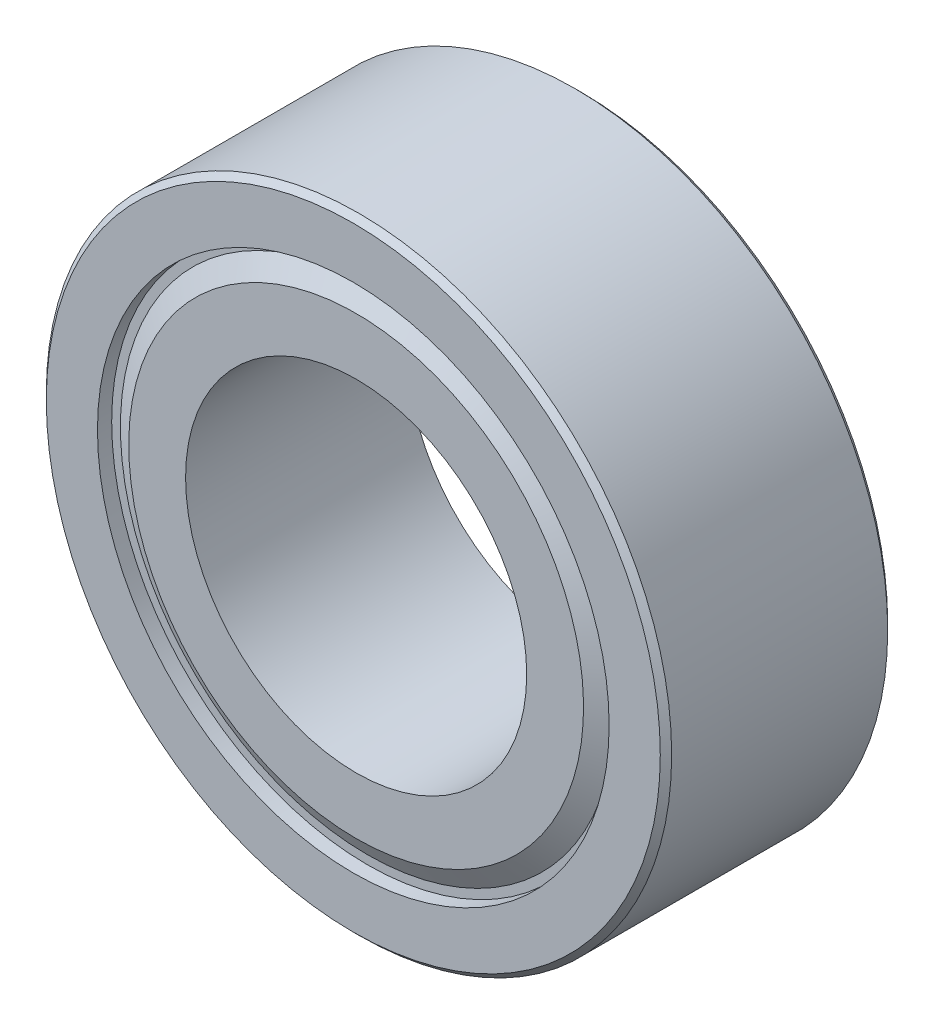
ISO-10303-21;
HEADER;
FILE_DESCRIPTION(('STEP AP214'),'2;1');
FILE_NAME('part.step','',(''),(''),'','','');
FILE_SCHEMA(('AUTOMOTIVE_DESIGN { 1 0 10303 214 1 1 1 1 }'));
ENDSEC;
DATA;
#1=APPLICATION_CONTEXT('core data for automotive mechanical design processes');
#2=APPLICATION_PROTOCOL_DEFINITION('international standard','automotive_design',2000,#1);
#3=PRODUCT_CONTEXT('',#1,'mechanical');
#4=PRODUCT('Part','Part','',(#3));
#5=PRODUCT_RELATED_PRODUCT_CATEGORY('part','',(#4));
#6=PRODUCT_DEFINITION_FORMATION('','',#4);
#7=PRODUCT_DEFINITION_CONTEXT('part definition',#1,'design');
#8=PRODUCT_DEFINITION('design','',#6,#7);
#9=PRODUCT_DEFINITION_SHAPE('','',#8);
#10=(LENGTH_UNIT() NAMED_UNIT(*) SI_UNIT(.MILLI.,.METRE.));
#11=(NAMED_UNIT(*) PLANE_ANGLE_UNIT() SI_UNIT($,.RADIAN.));
#12=(NAMED_UNIT(*) SI_UNIT($,.STERADIAN.) SOLID_ANGLE_UNIT());
#13=UNCERTAINTY_MEASURE_WITH_UNIT(LENGTH_MEASURE(1.E-05),#10,'distance_accuracy_value','');
#14=(GEOMETRIC_REPRESENTATION_CONTEXT(3) GLOBAL_UNCERTAINTY_ASSIGNED_CONTEXT((#13)) GLOBAL_UNIT_ASSIGNED_CONTEXT((#10,
#11,#12)) REPRESENTATION_CONTEXT('',''));
#15=CARTESIAN_POINT('',(0.,0.,0.));
#16=DIRECTION('',(0.,0.,1.));
#17=DIRECTION('',(1.,0.,0.));
#18=AXIS2_PLACEMENT_3D('',#15,#16,#17);
#19=CARTESIAN_POINT('',(0.,-1.65574434004337E-12,-1.12500000000007));
#20=DIRECTION('',(0.,0.,-1.));
#21=DIRECTION('',(0.,1.,0.));
#22=AXIS2_PLACEMENT_3D('',#19,#20,#21);
#23=CYLINDRICAL_SURFACE('',#22,4.50000000000236);
#24=CARTESIAN_POINT('',(0.,-1.65557290854692E-12,-1.25000000000007));
#25=DIRECTION('',(0.,0.,-1.));
#26=DIRECTION('',(1.,0.,0.));
#27=AXIS2_PLACEMENT_3D('',#24,#25,#26);
#28=CIRCLE('',#27,4.50000000000236);
#29=CARTESIAN_POINT('',(0.,-4.50000000000402,-1.25000000000007));
#30=VERTEX_POINT('',#29);
#31=EDGE_CURVE('E27',#30,#30,#28,.T.);
#32=ORIENTED_EDGE('',*,*,#31,.T.);
#33=DIRECTION('',(0.,0.,1.));
#34=VECTOR('',#33,1.);
#35=CARTESIAN_POINT('',(0.,-4.50000000000402,-1.12500000000007));
#36=LINE('',#35,#34);
#37=CARTESIAN_POINT('',(0.,-4.50000000000402,-1.00000000000007));
#38=VERTEX_POINT('',#37);
#39=EDGE_CURVE('E11',#30,#38,#36,.T.);
#40=ORIENTED_EDGE('',*,*,#39,.T.);
#41=CARTESIAN_POINT('',(0.,-1.65591577153982E-12,-1.00000000000007));
#42=DIRECTION('',(0.,0.,-1.));
#43=DIRECTION('',(1.,0.,0.));
#44=AXIS2_PLACEMENT_3D('',#41,#42,#43);
#45=CIRCLE('',#44,4.50000000000236);
#46=EDGE_CURVE('E131',#38,#38,#45,.T.);
#47=ORIENTED_EDGE('',*,*,#46,.F.);
#48=ORIENTED_EDGE('',*,*,#39,.F.);
#49=EDGE_LOOP('',(#32,#40,#47,#48));
#50=FACE_BOUND('',#49,.T.);
#51=ADVANCED_FACE('F18',(#50),#23,.F.);
#52=CARTESIAN_POINT('',(0.,4.5000000000007,-1.25000000000006));
#53=DIRECTION('',(0.,0.,1.));
#54=DIRECTION('',(0.,-1.,0.));
#55=AXIS2_PLACEMENT_3D('',#52,#53,#54);
#56=PLANE('',#55);
#57=CARTESIAN_POINT('',(0.,-1.65557290854692E-12,-1.25000000000006));
#58=DIRECTION('',(0.,0.,-1.));
#59=DIRECTION('',(1.,0.,0.));
#60=AXIS2_PLACEMENT_3D('',#57,#58,#59);
#61=CIRCLE('',#60,4.34641016151375);
#62=CARTESIAN_POINT('',(0.,-4.34641016151541,-1.25000000000007));
#63=VERTEX_POINT('',#62);
#64=EDGE_CURVE('E168',#63,#63,#61,.T.);
#65=ORIENTED_EDGE('',*,*,#64,.T.);
#66=EDGE_LOOP('',(#65));
#67=FACE_BOUND('',#66,.T.);
#68=ORIENTED_EDGE('',*,*,#31,.F.);
#69=EDGE_LOOP('',(#68));
#70=FACE_BOUND('',#69,.T.);
#71=ADVANCED_FACE('F20',(#67,#70),#56,.T.);
#72=CARTESIAN_POINT('',(0.,-1.65571005374408E-12,-1.15000000000007));
#73=DIRECTION('',(0.,0.,-1.));
#74=DIRECTION('',(0.,1.,0.));
#75=AXIS2_PLACEMENT_3D('',#72,#73,#74);
#76=CONICAL_SURFACE('',#75,4.17320508075688,1.04719755119659);
#77=ORIENTED_EDGE('',*,*,#64,.F.);
#78=DIRECTION('',(0.,0.866025403784435,0.500000000000007));
#79=VECTOR('',#78,1.);
#80=CARTESIAN_POINT('',(0.,-4.17320508075853,-1.15000000000007));
#81=LINE('',#80,#79);
#82=CARTESIAN_POINT('',(0.,-4.00000000000166,-1.05000000000008));
#83=VERTEX_POINT('',#82);
#84=EDGE_CURVE('E48',#63,#83,#81,.T.);
#85=ORIENTED_EDGE('',*,*,#84,.T.);
#86=CARTESIAN_POINT('',(0.,-1.65584719894124E-12,-1.05000000000008));
#87=DIRECTION('',(0.,0.,-1.));
#88=DIRECTION('',(1.,0.,0.));
#89=AXIS2_PLACEMENT_3D('',#86,#87,#88);
#90=CIRCLE('',#89,4.);
#91=EDGE_CURVE('E165',#83,#83,#90,.T.);
#92=ORIENTED_EDGE('',*,*,#91,.T.);
#93=ORIENTED_EDGE('',*,*,#84,.F.);
#94=EDGE_LOOP('',(#77,#85,#92,#93));
#95=FACE_BOUND('',#94,.T.);
#96=ADVANCED_FACE('F177',(#95),#76,.T.);
#97=CARTESIAN_POINT('',(0.,3.99999999999835,-1.05000000000007));
#98=DIRECTION('',(0.,0.,1.));
#99=DIRECTION('',(0.,-1.,0.));
#100=AXIS2_PLACEMENT_3D('',#97,#98,#99);
#101=PLANE('',#100);
#102=CARTESIAN_POINT('',(0.,-1.65584719894124E-12,-1.05000000000007));
#103=DIRECTION('',(0.,0.,-1.));
#104=DIRECTION('',(1.,0.,0.));
#105=AXIS2_PLACEMENT_3D('',#102,#103,#104);
#106=CIRCLE('',#105,3.);
#107=CARTESIAN_POINT('',(0.,-3.00000000000166,-1.05000000000008));
#108=VERTEX_POINT('',#107);
#109=EDGE_CURVE('E162',#108,#108,#106,.T.);
#110=ORIENTED_EDGE('',*,*,#109,.T.);
#111=EDGE_LOOP('',(#110));
#112=FACE_BOUND('',#111,.T.);
#113=ORIENTED_EDGE('',*,*,#91,.F.);
#114=EDGE_LOOP('',(#113));
#115=FACE_BOUND('',#114,.T.);
#116=ADVANCED_FACE('F184',(#112,#115),#101,.T.);
#117=CARTESIAN_POINT('',(0.,-1.65451003326894E-12,-2.02500000000007));
#118=DIRECTION('',(0.,0.,-1.));
#119=DIRECTION('',(0.,1.,0.));
#120=AXIS2_PLACEMENT_3D('',#117,#118,#119);
#121=CYLINDRICAL_SURFACE('',#120,3.);
#122=CARTESIAN_POINT('',(0.,-1.65049853625202E-12,-4.95000000000006));
#123=DIRECTION('',(0.,0.,-1.));
#124=DIRECTION('',(1.,0.,0.));
#125=AXIS2_PLACEMENT_3D('',#122,#123,#124);
#126=CIRCLE('',#125,3.);
#127=CARTESIAN_POINT('',(0.,-3.00000000000166,-4.95000000000006));
#128=VERTEX_POINT('',#127);
#129=EDGE_CURVE('E122',#128,#128,#126,.T.);
#130=ORIENTED_EDGE('',*,*,#129,.T.);
#131=DIRECTION('',(0.,0.,1.));
#132=VECTOR('',#131,1.);
#133=CARTESIAN_POINT('',(0.,-3.00000000000166,-2.02500000000007));
#134=LINE('',#133,#132);
#135=EDGE_CURVE('E158',#128,#108,#134,.T.);
#136=ORIENTED_EDGE('',*,*,#135,.T.);
#137=ORIENTED_EDGE('',*,*,#109,.F.);
#138=ORIENTED_EDGE('',*,*,#135,.F.);
#139=EDGE_LOOP('',(#130,#136,#137,#138));
#140=FACE_BOUND('',#139,.T.);
#141=ADVANCED_FACE('F189',(#140),#121,.F.);
#142=CARTESIAN_POINT('',(0.,-1.65447574696965E-12,-2.05000000000006));
#143=DIRECTION('',(0.,0.,-1.));
#144=DIRECTION('',(0.,1.,0.));
#145=AXIS2_PLACEMENT_3D('',#142,#143,#144);
#146=CYLINDRICAL_SURFACE('',#145,5.50000000000236);
#147=CARTESIAN_POINT('',(0.,-1.6505671088506E-12,-4.90000000000007));
#148=DIRECTION('',(0.,0.,-1.));
#149=DIRECTION('',(1.,0.,0.));
#150=AXIS2_PLACEMENT_3D('',#147,#148,#149);
#151=CIRCLE('',#150,5.50000000000236);
#152=CARTESIAN_POINT('',(0.,-5.50000000000401,-4.90000000000008));
#153=VERTEX_POINT('',#152);
#154=EDGE_CURVE('E103',#153,#153,#151,.T.);
#155=ORIENTED_EDGE('',*,*,#154,.F.);
#156=DIRECTION('',(0.,0.,1.));
#157=VECTOR('',#156,1.);
#158=CARTESIAN_POINT('',(0.,-5.50000000000401,-2.05000000000007));
#159=LINE('',#158,#157);
#160=CARTESIAN_POINT('',(0.,-5.50000000000401,-1.10000000000007));
#161=VERTEX_POINT('',#160);
#162=EDGE_CURVE('E148',#153,#161,#159,.T.);
#163=ORIENTED_EDGE('',*,*,#162,.T.);
#164=CARTESIAN_POINT('',(0.,-1.65577862634266E-12,-1.10000000000006));
#165=DIRECTION('',(0.,0.,-1.));
#166=DIRECTION('',(1.,0.,0.));
#167=AXIS2_PLACEMENT_3D('',#164,#165,#166);
#168=CIRCLE('',#167,5.50000000000236);
#169=EDGE_CURVE('E149',#161,#161,#168,.T.);
#170=ORIENTED_EDGE('',*,*,#169,.T.);
#171=ORIENTED_EDGE('',*,*,#162,.F.);
#172=EDGE_LOOP('',(#155,#163,#170,#171));
#173=FACE_BOUND('',#172,.T.);
#174=ADVANCED_FACE('F195',(#173),#146,.T.);
#175=CARTESIAN_POINT('',(0.,-1.65584719894124E-12,-1.05000000000006));
#176=DIRECTION('',(0.,0.,-1.));
#177=DIRECTION('',(0.,1.,0.));
#178=AXIS2_PLACEMENT_3D('',#175,#176,#177);
#179=CONICAL_SURFACE('',#178,5.45000000000236,0.785398163397442);
#180=ORIENTED_EDGE('',*,*,#169,.F.);
#181=DIRECTION('',(0.,0.707106781186542,0.707106781186553));
#182=VECTOR('',#181,1.);
#183=CARTESIAN_POINT('',(0.,-5.45000000000402,-1.05000000000007));
#184=LINE('',#183,#182);
#185=CARTESIAN_POINT('',(0.,-5.40000000000402,-1.00000000000007));
#186=VERTEX_POINT('',#185);
#187=EDGE_CURVE('E145',#161,#186,#184,.T.);
#188=ORIENTED_EDGE('',*,*,#187,.T.);
#189=CARTESIAN_POINT('',(0.,-1.65591577153982E-12,-1.00000000000007));
#190=DIRECTION('',(0.,0.,-1.));
#191=DIRECTION('',(1.,0.,0.));
#192=AXIS2_PLACEMENT_3D('',#189,#190,#191);
#193=CIRCLE('',#192,5.40000000000236);
#194=EDGE_CURVE('E128',#186,#186,#193,.T.);
#195=ORIENTED_EDGE('',*,*,#194,.T.);
#196=ORIENTED_EDGE('',*,*,#187,.F.);
#197=EDGE_LOOP('',(#180,#188,#195,#196));
#198=FACE_BOUND('',#197,.T.);
#199=ADVANCED_FACE('F201',(#198),#179,.T.);
#200=CARTESIAN_POINT('',(0.,5.40000000000071,-1.00000000000006));
#201=DIRECTION('',(0.,0.,1.));
#202=DIRECTION('',(0.,-1.,0.));
#203=AXIS2_PLACEMENT_3D('',#200,#201,#202);
#204=PLANE('',#203);
#205=ORIENTED_EDGE('',*,*,#46,.T.);
#206=EDGE_LOOP('',(#205));
#207=FACE_BOUND('',#206,.T.);
#208=ORIENTED_EDGE('',*,*,#194,.F.);
#209=EDGE_LOOP('',(#208));
#210=FACE_BOUND('',#209,.T.);
#211=ADVANCED_FACE('F207',(#207,#210),#204,.T.);
#212=CARTESIAN_POINT('',(0.,-1.65060139514989E-12,-4.87500000000007));
#213=DIRECTION('',(0.,0.,-1.));
#214=DIRECTION('',(0.,1.,0.));
#215=AXIS2_PLACEMENT_3D('',#212,#213,#214);
#216=CYLINDRICAL_SURFACE('',#215,4.50000000000236);
#217=CARTESIAN_POINT('',(0.,-1.65077282664634E-12,-4.75000000000007));
#218=DIRECTION('',(0.,0.,-1.));
#219=DIRECTION('',(1.,0.,0.));
#220=AXIS2_PLACEMENT_3D('',#217,#218,#219);
#221=CIRCLE('',#220,4.50000000000236);
#222=CARTESIAN_POINT('',(0.,-4.50000000000401,-4.75000000000007));
#223=VERTEX_POINT('',#222);
#224=EDGE_CURVE('E119',#223,#223,#221,.T.);
#225=ORIENTED_EDGE('',*,*,#224,.F.);
#226=DIRECTION('',(0.,0.,-1.));
#227=VECTOR('',#226,1.);
#228=CARTESIAN_POINT('',(0.,-4.50000000000401,-4.87500000000007));
#229=LINE('',#228,#227);
#230=CARTESIAN_POINT('',(0.,-4.50000000000401,-5.00000000000007));
#231=VERTEX_POINT('',#230);
#232=EDGE_CURVE('E132',#223,#231,#229,.T.);
#233=ORIENTED_EDGE('',*,*,#232,.T.);
#234=CARTESIAN_POINT('',(0.,-1.65042996365344E-12,-5.00000000000007));
#235=DIRECTION('',(0.,0.,-1.));
#236=DIRECTION('',(1.,0.,0.));
#237=AXIS2_PLACEMENT_3D('',#234,#235,#236);
#238=CIRCLE('',#237,4.50000000000236);
#239=EDGE_CURVE('E110',#231,#231,#238,.T.);
#240=ORIENTED_EDGE('',*,*,#239,.T.);
#241=ORIENTED_EDGE('',*,*,#232,.F.);
#242=EDGE_LOOP('',(#225,#233,#240,#241));
#243=FACE_BOUND('',#242,.T.);
#244=ADVANCED_FACE('F203',(#243),#216,.F.);
#245=CARTESIAN_POINT('',(0.,4.50000000000071,-4.75000000000006));
#246=DIRECTION('',(0.,0.,1.));
#247=DIRECTION('',(0.,-1.,0.));
#248=AXIS2_PLACEMENT_3D('',#245,#246,#247);
#249=PLANE('',#248);
#250=CARTESIAN_POINT('',(0.,-1.65077282664634E-12,-4.75000000000007));
#251=DIRECTION('',(0.,0.,-1.));
#252=DIRECTION('',(1.,0.,0.));
#253=AXIS2_PLACEMENT_3D('',#250,#251,#252);
#254=CIRCLE('',#253,4.34641016151375);
#255=CARTESIAN_POINT('',(0.,-4.3464101615154,-4.75000000000008));
#256=VERTEX_POINT('',#255);
#257=EDGE_CURVE('E120',#256,#256,#254,.T.);
#258=ORIENTED_EDGE('',*,*,#257,.F.);
#259=EDGE_LOOP('',(#258));
#260=FACE_BOUND('',#259,.T.);
#261=ORIENTED_EDGE('',*,*,#224,.T.);
#262=EDGE_LOOP('',(#261));
#263=FACE_BOUND('',#262,.T.);
#264=ADVANCED_FACE('F206',(#260,#263),#249,.F.);
#265=CARTESIAN_POINT('',(0.,-1.65063568144918E-12,-4.85000000000006));
#266=DIRECTION('',(0.,0.,1.));
#267=DIRECTION('',(0.,1.,0.));
#268=AXIS2_PLACEMENT_3D('',#265,#266,#267);
#269=CONICAL_SURFACE('',#268,4.17320508075688,1.04719755119659);
#270=ORIENTED_EDGE('',*,*,#257,.T.);
#271=DIRECTION('',(0.,0.866025403784436,-0.5));
#272=VECTOR('',#271,1.);
#273=CARTESIAN_POINT('',(0.,-4.17320508075853,-4.85000000000007));
#274=LINE('',#273,#272);
#275=CARTESIAN_POINT('',(0.,-4.00000000000166,-4.95000000000006));
#276=VERTEX_POINT('',#275);
#277=EDGE_CURVE('E118',#256,#276,#274,.T.);
#278=ORIENTED_EDGE('',*,*,#277,.T.);
#279=CARTESIAN_POINT('',(0.,-1.65049853625202E-12,-4.95000000000006));
#280=DIRECTION('',(0.,0.,-1.));
#281=DIRECTION('',(1.,0.,0.));
#282=AXIS2_PLACEMENT_3D('',#279,#280,#281);
#283=CIRCLE('',#282,4.);
#284=EDGE_CURVE('E105',#276,#276,#283,.T.);
#285=ORIENTED_EDGE('',*,*,#284,.F.);
#286=ORIENTED_EDGE('',*,*,#277,.F.);
#287=EDGE_LOOP('',(#270,#278,#285,#286));
#288=FACE_BOUND('',#287,.T.);
#289=ADVANCED_FACE('F213',(#288),#269,.T.);
#290=CARTESIAN_POINT('',(0.,3.99999999999836,-4.95));
#291=DIRECTION('',(0.,0.,1.));
#292=DIRECTION('',(0.,-1.,0.));
#293=AXIS2_PLACEMENT_3D('',#290,#291,#292);
#294=PLANE('',#293);
#295=ORIENTED_EDGE('',*,*,#129,.F.);
#296=EDGE_LOOP('',(#295));
#297=FACE_BOUND('',#296,.T.);
#298=ORIENTED_EDGE('',*,*,#284,.T.);
#299=EDGE_LOOP('',(#298));
#300=FACE_BOUND('',#299,.T.);
#301=ADVANCED_FACE('F218',(#297,#300),#294,.F.);
#302=CARTESIAN_POINT('',(0.,-1.65049853625202E-12,-4.95000000000007));
#303=DIRECTION('',(0.,0.,1.));
#304=DIRECTION('',(0.,1.,0.));
#305=AXIS2_PLACEMENT_3D('',#302,#303,#304);
#306=CONICAL_SURFACE('',#305,5.45000000000236,0.785398163397442);
#307=ORIENTED_EDGE('',*,*,#154,.T.);
#308=DIRECTION('',(0.,0.707106781186544,-0.707106781186551));
#309=VECTOR('',#308,1.);
#310=CARTESIAN_POINT('',(0.,-5.45000000000401,-4.95000000000008));
#311=LINE('',#310,#309);
#312=CARTESIAN_POINT('',(0.,-5.40000000000402,-5.00000000000007));
#313=VERTEX_POINT('',#312);
#314=EDGE_CURVE('E98',#153,#313,#311,.T.);
#315=ORIENTED_EDGE('',*,*,#314,.T.);
#316=CARTESIAN_POINT('',(0.,-1.65042996365344E-12,-5.00000000000006));
#317=DIRECTION('',(0.,0.,-1.));
#318=DIRECTION('',(1.,0.,0.));
#319=AXIS2_PLACEMENT_3D('',#316,#317,#318);
#320=CIRCLE('',#319,5.40000000000236);
#321=EDGE_CURVE('E101',#313,#313,#320,.T.);
#322=ORIENTED_EDGE('',*,*,#321,.F.);
#323=ORIENTED_EDGE('',*,*,#314,.F.);
#324=EDGE_LOOP('',(#307,#315,#322,#323));
#325=FACE_BOUND('',#324,.T.);
#326=ADVANCED_FACE('F100',(#325),#306,.T.);
#327=CARTESIAN_POINT('',(0.,5.40000000000072,-5.00000000000006));
#328=DIRECTION('',(0.,0.,1.));
#329=DIRECTION('',(0.,-1.,0.));
#330=AXIS2_PLACEMENT_3D('',#327,#328,#329);
#331=PLANE('',#330);
#332=ORIENTED_EDGE('',*,*,#239,.F.);
#333=EDGE_LOOP('',(#332));
#334=FACE_BOUND('',#333,.T.);
#335=ORIENTED_EDGE('',*,*,#321,.T.);
#336=EDGE_LOOP('',(#335));
#337=FACE_BOUND('',#336,.T.);
#338=ADVANCED_FACE('F108',(#334,#337),#331,.F.);
#339=CLOSED_SHELL('',(#51,#71,#96,#116,#141,#174,#199,#211,#244,#264,#289,#301,#326,#338));
#340=MANIFOLD_SOLID_BREP('B1',#339);
#341=ADVANCED_BREP_SHAPE_REPRESENTATION('',(#18,#340),#14);
#342=SHAPE_DEFINITION_REPRESENTATION(#9,#341);
ENDSEC;
END-ISO-10303-21;
